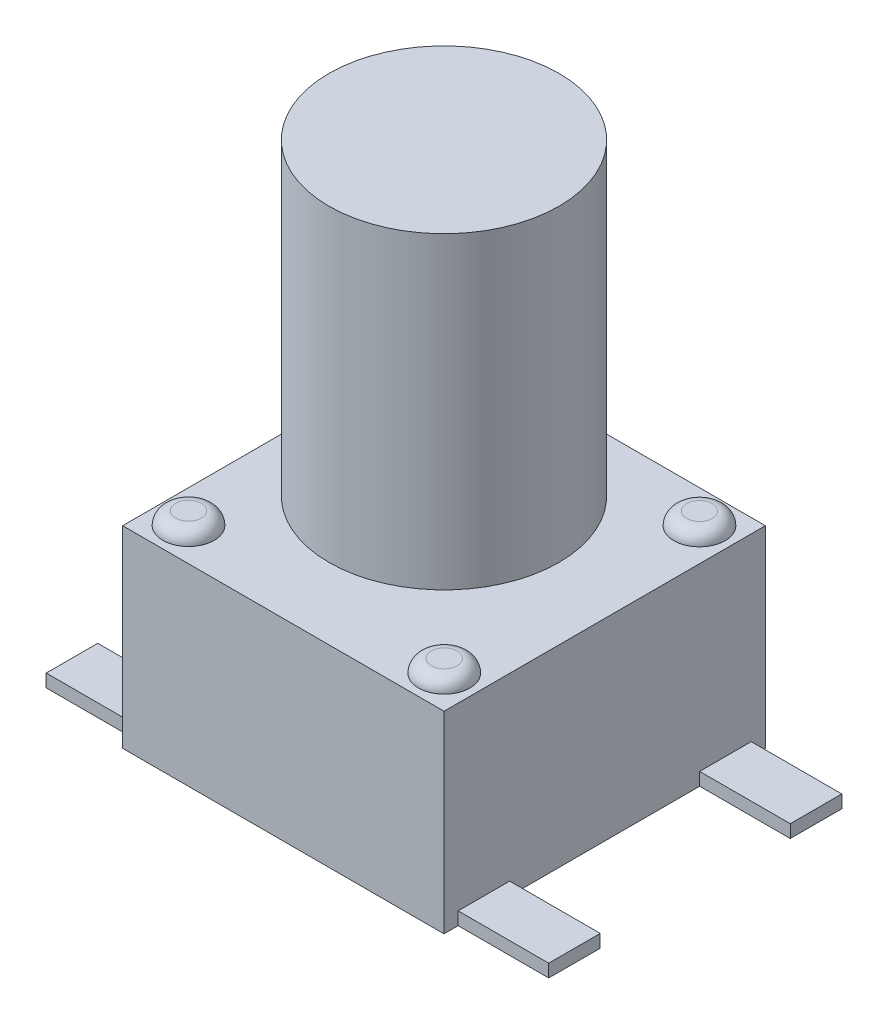
ISO-10303-21;
HEADER;
FILE_DESCRIPTION(('STEP AP214'),'2;1');
FILE_NAME('part.step','',(''),(''),'','','');
FILE_SCHEMA(('AUTOMOTIVE_DESIGN { 1 0 10303 214 1 1 1 1 }'));
ENDSEC;
DATA;
#1=APPLICATION_CONTEXT('core data for automotive mechanical design processes');
#2=APPLICATION_PROTOCOL_DEFINITION('international standard','automotive_design',2000,#1);
#3=PRODUCT_CONTEXT('',#1,'mechanical');
#4=PRODUCT('Part','Part','',(#3));
#5=PRODUCT_RELATED_PRODUCT_CATEGORY('part','',(#4));
#6=PRODUCT_DEFINITION_FORMATION('','',#4);
#7=PRODUCT_DEFINITION_CONTEXT('part definition',#1,'design');
#8=PRODUCT_DEFINITION('design','',#6,#7);
#9=PRODUCT_DEFINITION_SHAPE('','',#8);
#10=(LENGTH_UNIT() NAMED_UNIT(*) SI_UNIT(.MILLI.,.METRE.));
#11=(NAMED_UNIT(*) PLANE_ANGLE_UNIT() SI_UNIT($,.RADIAN.));
#12=(NAMED_UNIT(*) SI_UNIT($,.STERADIAN.) SOLID_ANGLE_UNIT());
#13=UNCERTAINTY_MEASURE_WITH_UNIT(LENGTH_MEASURE(1.E-05),#10,'distance_accuracy_value','');
#14=(GEOMETRIC_REPRESENTATION_CONTEXT(3) GLOBAL_UNCERTAINTY_ASSIGNED_CONTEXT((#13)) GLOBAL_UNIT_ASSIGNED_CONTEXT((#10,
#11,#12)) REPRESENTATION_CONTEXT('',''));
#15=CARTESIAN_POINT('',(0.,0.,0.));
#16=DIRECTION('',(0.,0.,1.));
#17=DIRECTION('',(1.,0.,0.));
#18=AXIS2_PLACEMENT_3D('',#15,#16,#17);
#19=CARTESIAN_POINT('',(3.175,3.81,-3.175));
#20=DIRECTION('',(0.,-1.,0.));
#21=DIRECTION('',(0.,0.,-1.));
#22=AXIS2_PLACEMENT_3D('',#19,#20,#21);
#23=PLANE('',#22);
#24=CARTESIAN_POINT('',(-2.5268305975324,3.81,2.52160987315735));
#25=DIRECTION('',(0.,-1.,0.));
#26=DIRECTION('',(0.,0.,-1.));
#27=AXIS2_PLACEMENT_3D('',#24,#25,#26);
#28=CIRCLE('',#27,0.508);
#29=CARTESIAN_POINT('',(-2.5268305975324,3.81,2.01360987315735));
#30=VERTEX_POINT('',#29);
#31=EDGE_CURVE('E488',#30,#30,#28,.F.);
#32=ORIENTED_EDGE('',*,*,#31,.F.);
#33=EDGE_LOOP('',(#32));
#34=FACE_BOUND('',#33,.T.);
#35=CARTESIAN_POINT('',(2.5268305975324,3.81,-2.52160987315735));
#36=DIRECTION('',(0.,-1.,0.));
#37=DIRECTION('',(0.,0.,-1.));
#38=AXIS2_PLACEMENT_3D('',#35,#36,#37);
#39=CIRCLE('',#38,0.508);
#40=CARTESIAN_POINT('',(2.5268305975324,3.81,-3.02960987315735));
#41=VERTEX_POINT('',#40);
#42=EDGE_CURVE('E491',#41,#41,#39,.F.);
#43=ORIENTED_EDGE('',*,*,#42,.F.);
#44=EDGE_LOOP('',(#43));
#45=FACE_BOUND('',#44,.T.);
#46=DIRECTION('',(0.,0.,-1.));
#47=VECTOR('',#46,1.);
#48=CARTESIAN_POINT('',(3.175,3.81,3.175));
#49=LINE('',#48,#47);
#50=CARTESIAN_POINT('',(3.175,3.81,3.175));
#51=VERTEX_POINT('',#50);
#52=CARTESIAN_POINT('',(3.175,3.81,-3.175));
#53=VERTEX_POINT('',#52);
#54=EDGE_CURVE('E303',#51,#53,#49,.T.);
#55=ORIENTED_EDGE('',*,*,#54,.T.);
#56=DIRECTION('',(-1.,0.,0.));
#57=VECTOR('',#56,1.);
#58=CARTESIAN_POINT('',(-3.175,3.81,-3.175));
#59=LINE('',#58,#57);
#60=CARTESIAN_POINT('',(-3.175,3.81,-3.175));
#61=VERTEX_POINT('',#60);
#62=EDGE_CURVE('E300',#53,#61,#59,.T.);
#63=ORIENTED_EDGE('',*,*,#62,.T.);
#64=DIRECTION('',(0.,0.,1.));
#65=VECTOR('',#64,1.);
#66=CARTESIAN_POINT('',(-3.175,3.81,3.175));
#67=LINE('',#66,#65);
#68=CARTESIAN_POINT('',(-3.175,3.81,3.175));
#69=VERTEX_POINT('',#68);
#70=EDGE_CURVE('E296',#61,#69,#67,.T.);
#71=ORIENTED_EDGE('',*,*,#70,.T.);
#72=DIRECTION('',(1.,0.,0.));
#73=VECTOR('',#72,1.);
#74=CARTESIAN_POINT('',(-3.175,3.81,3.175));
#75=LINE('',#74,#73);
#76=EDGE_CURVE('E255',#69,#51,#75,.T.);
#77=ORIENTED_EDGE('',*,*,#76,.T.);
#78=EDGE_LOOP('',(#55,#63,#71,#77));
#79=FACE_BOUND('',#78,.T.);
#80=CARTESIAN_POINT('',(-2.5268305975324,3.81,-2.52160987315735));
#81=DIRECTION('',(0.,-1.,0.));
#82=DIRECTION('',(0.,0.,-1.));
#83=AXIS2_PLACEMENT_3D('',#80,#81,#82);
#84=CIRCLE('',#83,0.508);
#85=CARTESIAN_POINT('',(-2.5268305975324,3.81,-3.02960987315735));
#86=VERTEX_POINT('',#85);
#87=EDGE_CURVE('E250',#86,#86,#84,.F.);
#88=ORIENTED_EDGE('',*,*,#87,.F.);
#89=EDGE_LOOP('',(#88));
#90=FACE_BOUND('',#89,.T.);
#91=CARTESIAN_POINT('',(2.5268305975324,3.81,2.52160987315735));
#92=DIRECTION('',(0.,-1.,0.));
#93=DIRECTION('',(0.,0.,-1.));
#94=AXIS2_PLACEMENT_3D('',#91,#92,#93);
#95=CIRCLE('',#94,0.508);
#96=CARTESIAN_POINT('',(2.5268305975324,3.81,2.01360987315735));
#97=VERTEX_POINT('',#96);
#98=EDGE_CURVE('E474',#97,#97,#95,.F.);
#99=ORIENTED_EDGE('',*,*,#98,.F.);
#100=EDGE_LOOP('',(#99));
#101=FACE_BOUND('',#100,.T.);
#102=CARTESIAN_POINT('',(0.,3.81,0.));
#103=DIRECTION('',(0.,-1.,0.));
#104=DIRECTION('',(0.,0.,-1.));
#105=AXIS2_PLACEMENT_3D('',#102,#103,#104);
#106=CIRCLE('',#105,1.36304718396633);
#107=CARTESIAN_POINT('',(0.,3.81,-1.36304718396633));
#108=VERTEX_POINT('',#107);
#109=EDGE_CURVE('E11',#108,#108,#106,.F.);
#110=ORIENTED_EDGE('',*,*,#109,.F.);
#111=EDGE_LOOP('',(#110));
#112=FACE_BOUND('',#111,.T.);
#113=ADVANCED_FACE('F35',(#34,#45,#79,#90,#101,#112),#23,.F.);
#114=CARTESIAN_POINT('',(3.175,3.81,3.175));
#115=DIRECTION('',(-1.,0.,0.));
#116=DIRECTION('',(0.,0.,1.));
#117=AXIS2_PLACEMENT_3D('',#114,#115,#116);
#118=PLANE('',#117);
#119=DIRECTION('',(0.,0.,-1.));
#120=VECTOR('',#119,1.);
#121=CARTESIAN_POINT('',(3.175,0.,3.175));
#122=LINE('',#121,#120);
#123=CARTESIAN_POINT('',(3.175,0.,1.87744641540056));
#124=VERTEX_POINT('',#123);
#125=CARTESIAN_POINT('',(3.175,0.,-1.87744641540056));
#126=VERTEX_POINT('',#125);
#127=EDGE_CURVE('E248',#124,#126,#122,.T.);
#128=ORIENTED_EDGE('',*,*,#127,.T.);
#129=DIRECTION('',(0.,-1.,0.));
#130=VECTOR('',#129,1.);
#131=CARTESIAN_POINT('',(3.175,0.254,-1.87744641540056));
#132=LINE('',#131,#130);
#133=CARTESIAN_POINT('',(3.175,0.254,-1.87744641540056));
#134=VERTEX_POINT('',#133);
#135=EDGE_CURVE('E50',#134,#126,#132,.T.);
#136=ORIENTED_EDGE('',*,*,#135,.F.);
#137=DIRECTION('',(0.,0.,-1.));
#138=VECTOR('',#137,1.);
#139=CARTESIAN_POINT('',(3.175,0.254,-1.87744641540056));
#140=LINE('',#139,#138);
#141=CARTESIAN_POINT('',(3.175,0.254,-2.8956));
#142=VERTEX_POINT('',#141);
#143=EDGE_CURVE('E54',#134,#142,#140,.T.);
#144=ORIENTED_EDGE('',*,*,#143,.T.);
#145=DIRECTION('',(0.,-1.,0.));
#146=VECTOR('',#145,1.);
#147=CARTESIAN_POINT('',(3.175,0.254,-2.8956));
#148=LINE('',#147,#146);
#149=CARTESIAN_POINT('',(3.175,0.,-2.8956));
#150=VERTEX_POINT('',#149);
#151=EDGE_CURVE('E182',#142,#150,#148,.T.);
#152=ORIENTED_EDGE('',*,*,#151,.T.);
#153=CARTESIAN_POINT('',(3.175,0.,-3.175));
#154=VERTEX_POINT('',#153);
#155=EDGE_CURVE('E245',#150,#154,#122,.T.);
#156=ORIENTED_EDGE('',*,*,#155,.T.);
#157=DIRECTION('',(0.,-1.,0.));
#158=VECTOR('',#157,1.);
#159=CARTESIAN_POINT('',(3.175,3.81,-3.175));
#160=LINE('',#159,#158);
#161=EDGE_CURVE('E283',#53,#154,#160,.T.);
#162=ORIENTED_EDGE('',*,*,#161,.F.);
#163=ORIENTED_EDGE('',*,*,#54,.F.);
#164=DIRECTION('',(0.,-1.,0.));
#165=VECTOR('',#164,1.);
#166=CARTESIAN_POINT('',(3.175,3.81,3.175));
#167=LINE('',#166,#165);
#168=CARTESIAN_POINT('',(3.175,0.,3.175));
#169=VERTEX_POINT('',#168);
#170=EDGE_CURVE('E291',#51,#169,#167,.T.);
#171=ORIENTED_EDGE('',*,*,#170,.T.);
#172=CARTESIAN_POINT('',(3.175,0.,2.8956));
#173=VERTEX_POINT('',#172);
#174=EDGE_CURVE('E263',#169,#173,#122,.T.);
#175=ORIENTED_EDGE('',*,*,#174,.T.);
#176=DIRECTION('',(0.,-1.,0.));
#177=VECTOR('',#176,1.);
#178=CARTESIAN_POINT('',(3.175,0.254,2.8956));
#179=LINE('',#178,#177);
#180=CARTESIAN_POINT('',(3.175,0.254,2.8956));
#181=VERTEX_POINT('',#180);
#182=EDGE_CURVE('E235',#181,#173,#179,.T.);
#183=ORIENTED_EDGE('',*,*,#182,.F.);
#184=DIRECTION('',(0.,0.,-1.));
#185=VECTOR('',#184,1.);
#186=CARTESIAN_POINT('',(3.175,0.254,1.87744641540056));
#187=LINE('',#186,#185);
#188=CARTESIAN_POINT('',(3.175,0.254,1.87744641540056));
#189=VERTEX_POINT('',#188);
#190=EDGE_CURVE('E214',#181,#189,#187,.T.);
#191=ORIENTED_EDGE('',*,*,#190,.T.);
#192=DIRECTION('',(0.,-1.,0.));
#193=VECTOR('',#192,1.);
#194=CARTESIAN_POINT('',(3.175,0.254,1.87744641540056));
#195=LINE('',#194,#193);
#196=EDGE_CURVE('E227',#189,#124,#195,.T.);
#197=ORIENTED_EDGE('',*,*,#196,.T.);
#198=EDGE_LOOP('',(#128,#136,#144,#152,#156,#162,#163,#171,#175,#183,#191,#197));
#199=FACE_BOUND('',#198,.T.);
#200=ADVANCED_FACE('F392',(#199),#118,.F.);
#201=CARTESIAN_POINT('',(-3.175,3.81,3.175));
#202=DIRECTION('',(1.,0.,0.));
#203=DIRECTION('',(0.,0.,-1.));
#204=AXIS2_PLACEMENT_3D('',#201,#202,#203);
#205=PLANE('',#204);
#206=DIRECTION('',(0.,0.,1.));
#207=VECTOR('',#206,1.);
#208=CARTESIAN_POINT('',(-3.175,0.,3.175));
#209=LINE('',#208,#207);
#210=CARTESIAN_POINT('',(-3.175,0.,-1.87744641540056));
#211=VERTEX_POINT('',#210);
#212=CARTESIAN_POINT('',(-3.175,0.,1.87744641540056));
#213=VERTEX_POINT('',#212);
#214=EDGE_CURVE('E268',#211,#213,#209,.T.);
#215=ORIENTED_EDGE('',*,*,#214,.T.);
#216=DIRECTION('',(0.,-1.,0.));
#217=VECTOR('',#216,1.);
#218=CARTESIAN_POINT('',(-3.175,0.254,1.87744641540056));
#219=LINE('',#218,#217);
#220=CARTESIAN_POINT('',(-3.175,0.254,1.87744641540056));
#221=VERTEX_POINT('',#220);
#222=EDGE_CURVE('E332',#221,#213,#219,.T.);
#223=ORIENTED_EDGE('',*,*,#222,.F.);
#224=DIRECTION('',(0.,0.,1.));
#225=VECTOR('',#224,1.);
#226=CARTESIAN_POINT('',(-3.175,0.254,1.87744641540056));
#227=LINE('',#226,#225);
#228=CARTESIAN_POINT('',(-3.175,0.254,2.8956));
#229=VERTEX_POINT('',#228);
#230=EDGE_CURVE('E358',#221,#229,#227,.T.);
#231=ORIENTED_EDGE('',*,*,#230,.T.);
#232=DIRECTION('',(0.,-1.,0.));
#233=VECTOR('',#232,1.);
#234=CARTESIAN_POINT('',(-3.175,0.254,2.8956));
#235=LINE('',#234,#233);
#236=CARTESIAN_POINT('',(-3.175,0.,2.8956));
#237=VERTEX_POINT('',#236);
#238=EDGE_CURVE('E348',#229,#237,#235,.T.);
#239=ORIENTED_EDGE('',*,*,#238,.T.);
#240=CARTESIAN_POINT('',(-3.175,0.,3.175));
#241=VERTEX_POINT('',#240);
#242=EDGE_CURVE('E266',#237,#241,#209,.T.);
#243=ORIENTED_EDGE('',*,*,#242,.T.);
#244=DIRECTION('',(0.,-1.,0.));
#245=VECTOR('',#244,1.);
#246=CARTESIAN_POINT('',(-3.175,3.81,3.175));
#247=LINE('',#246,#245);
#248=EDGE_CURVE('E289',#69,#241,#247,.T.);
#249=ORIENTED_EDGE('',*,*,#248,.F.);
#250=ORIENTED_EDGE('',*,*,#70,.F.);
#251=DIRECTION('',(0.,-1.,0.));
#252=VECTOR('',#251,1.);
#253=CARTESIAN_POINT('',(-3.175,3.81,-3.175));
#254=LINE('',#253,#252);
#255=CARTESIAN_POINT('',(-3.175,0.,-3.175));
#256=VERTEX_POINT('',#255);
#257=EDGE_CURVE('E286',#61,#256,#254,.T.);
#258=ORIENTED_EDGE('',*,*,#257,.T.);
#259=CARTESIAN_POINT('',(-3.175,0.,-2.8956));
#260=VERTEX_POINT('',#259);
#261=EDGE_CURVE('E280',#256,#260,#209,.T.);
#262=ORIENTED_EDGE('',*,*,#261,.T.);
#263=DIRECTION('',(0.,-1.,0.));
#264=VECTOR('',#263,1.);
#265=CARTESIAN_POINT('',(-3.175,0.254,-2.8956));
#266=LINE('',#265,#264);
#267=CARTESIAN_POINT('',(-3.175,0.254,-2.8956));
#268=VERTEX_POINT('',#267);
#269=EDGE_CURVE('E309',#268,#260,#266,.T.);
#270=ORIENTED_EDGE('',*,*,#269,.F.);
#271=DIRECTION('',(0.,0.,1.));
#272=VECTOR('',#271,1.);
#273=CARTESIAN_POINT('',(-3.175,0.254,-1.87744641540056));
#274=LINE('',#273,#272);
#275=CARTESIAN_POINT('',(-3.175,0.254,-1.87744641540056));
#276=VERTEX_POINT('',#275);
#277=EDGE_CURVE('E340',#268,#276,#274,.T.);
#278=ORIENTED_EDGE('',*,*,#277,.T.);
#279=DIRECTION('',(0.,-1.,0.));
#280=VECTOR('',#279,1.);
#281=CARTESIAN_POINT('',(-3.175,0.254,-1.87744641540056));
#282=LINE('',#281,#280);
#283=EDGE_CURVE('E315',#276,#211,#282,.T.);
#284=ORIENTED_EDGE('',*,*,#283,.T.);
#285=EDGE_LOOP('',(#215,#223,#231,#239,#243,#249,#250,#258,#262,#270,#278,#284));
#286=FACE_BOUND('',#285,.T.);
#287=ADVANCED_FACE('F374',(#286),#205,.F.);
#288=CARTESIAN_POINT('',(-3.175,3.81,-3.175));
#289=DIRECTION('',(0.,0.,1.));
#290=DIRECTION('',(1.,0.,0.));
#291=AXIS2_PLACEMENT_3D('',#288,#289,#290);
#292=PLANE('',#291);
#293=DIRECTION('',(-1.,0.,0.));
#294=VECTOR('',#293,1.);
#295=CARTESIAN_POINT('',(-3.175,0.,-3.175));
#296=LINE('',#295,#294);
#297=EDGE_CURVE('E257',#154,#256,#296,.T.);
#298=ORIENTED_EDGE('',*,*,#297,.T.);
#299=ORIENTED_EDGE('',*,*,#257,.F.);
#300=ORIENTED_EDGE('',*,*,#62,.F.);
#301=ORIENTED_EDGE('',*,*,#161,.T.);
#302=EDGE_LOOP('',(#298,#299,#300,#301));
#303=FACE_BOUND('',#302,.T.);
#304=ADVANCED_FACE('F396',(#303),#292,.F.);
#305=CARTESIAN_POINT('',(-3.175,3.81,3.175));
#306=DIRECTION('',(0.,0.,-1.));
#307=DIRECTION('',(-1.,0.,0.));
#308=AXIS2_PLACEMENT_3D('',#305,#306,#307);
#309=PLANE('',#308);
#310=DIRECTION('',(1.,0.,0.));
#311=VECTOR('',#310,1.);
#312=CARTESIAN_POINT('',(-3.175,0.,3.175));
#313=LINE('',#312,#311);
#314=EDGE_CURVE('E273',#241,#169,#313,.T.);
#315=ORIENTED_EDGE('',*,*,#314,.T.);
#316=ORIENTED_EDGE('',*,*,#170,.F.);
#317=ORIENTED_EDGE('',*,*,#76,.F.);
#318=ORIENTED_EDGE('',*,*,#248,.T.);
#319=EDGE_LOOP('',(#315,#316,#317,#318));
#320=FACE_BOUND('',#319,.T.);
#321=ADVANCED_FACE('F390',(#320),#309,.F.);
#322=CARTESIAN_POINT('',(3.175,0.,-3.175));
#323=DIRECTION('',(0.,-1.,0.));
#324=DIRECTION('',(0.,0.,-1.));
#325=AXIS2_PLACEMENT_3D('',#322,#323,#324);
#326=PLANE('',#325);
#327=ORIENTED_EDGE('',*,*,#174,.F.);
#328=ORIENTED_EDGE('',*,*,#314,.F.);
#329=ORIENTED_EDGE('',*,*,#242,.F.);
#330=DIRECTION('',(-1.,0.,0.));
#331=VECTOR('',#330,1.);
#332=CARTESIAN_POINT('',(-4.96477558047559,0.,2.8956));
#333=LINE('',#332,#331);
#334=CARTESIAN_POINT('',(-4.96477558047559,0.,2.8956));
#335=VERTEX_POINT('',#334);
#336=EDGE_CURVE('E226',#237,#335,#333,.T.);
#337=ORIENTED_EDGE('',*,*,#336,.T.);
#338=DIRECTION('',(0.,0.,-1.));
#339=VECTOR('',#338,1.);
#340=CARTESIAN_POINT('',(-4.96477558047559,0.,1.87744641540056));
#341=LINE('',#340,#339);
#342=CARTESIAN_POINT('',(-4.96477558047559,0.,1.87744641540056));
#343=VERTEX_POINT('',#342);
#344=EDGE_CURVE('E359',#335,#343,#341,.T.);
#345=ORIENTED_EDGE('',*,*,#344,.T.);
#346=DIRECTION('',(1.,0.,0.));
#347=VECTOR('',#346,1.);
#348=CARTESIAN_POINT('',(-4.96477558047559,0.,1.87744641540056));
#349=LINE('',#348,#347);
#350=EDGE_CURVE('E355',#343,#213,#349,.T.);
#351=ORIENTED_EDGE('',*,*,#350,.T.);
#352=ORIENTED_EDGE('',*,*,#214,.F.);
#353=DIRECTION('',(-1.,0.,0.));
#354=VECTOR('',#353,1.);
#355=CARTESIAN_POINT('',(-4.96477558047559,0.,-1.87744641540056));
#356=LINE('',#355,#354);
#357=CARTESIAN_POINT('',(-4.96477558047559,0.,-1.87744641540056));
#358=VERTEX_POINT('',#357);
#359=EDGE_CURVE('E324',#211,#358,#356,.T.);
#360=ORIENTED_EDGE('',*,*,#359,.T.);
#361=DIRECTION('',(0.,0.,-1.));
#362=VECTOR('',#361,1.);
#363=CARTESIAN_POINT('',(-4.96477558047559,0.,-1.87744641540056));
#364=LINE('',#363,#362);
#365=CARTESIAN_POINT('',(-4.96477558047559,0.,-2.8956));
#366=VERTEX_POINT('',#365);
#367=EDGE_CURVE('E325',#358,#366,#364,.T.);
#368=ORIENTED_EDGE('',*,*,#367,.T.);
#369=DIRECTION('',(1.,0.,0.));
#370=VECTOR('',#369,1.);
#371=CARTESIAN_POINT('',(-4.96477558047559,0.,-2.8956));
#372=LINE('',#371,#370);
#373=EDGE_CURVE('E322',#366,#260,#372,.T.);
#374=ORIENTED_EDGE('',*,*,#373,.T.);
#375=ORIENTED_EDGE('',*,*,#261,.F.);
#376=ORIENTED_EDGE('',*,*,#297,.F.);
#377=ORIENTED_EDGE('',*,*,#155,.F.);
#378=DIRECTION('',(1.,0.,0.));
#379=VECTOR('',#378,1.);
#380=CARTESIAN_POINT('',(4.96477558047559,0.,-2.8956));
#381=LINE('',#380,#379);
#382=CARTESIAN_POINT('',(4.96477558047559,0.,-2.8956));
#383=VERTEX_POINT('',#382);
#384=EDGE_CURVE('E200',#150,#383,#381,.T.);
#385=ORIENTED_EDGE('',*,*,#384,.T.);
#386=DIRECTION('',(0.,0.,1.));
#387=VECTOR('',#386,1.);
#388=CARTESIAN_POINT('',(4.96477558047559,0.,-1.87744641540056));
#389=LINE('',#388,#387);
#390=CARTESIAN_POINT('',(4.96477558047559,0.,-1.87744641540056));
#391=VERTEX_POINT('',#390);
#392=EDGE_CURVE('E177',#383,#391,#389,.T.);
#393=ORIENTED_EDGE('',*,*,#392,.T.);
#394=DIRECTION('',(-1.,0.,0.));
#395=VECTOR('',#394,1.);
#396=CARTESIAN_POINT('',(4.96477558047559,0.,-1.87744641540056));
#397=LINE('',#396,#395);
#398=EDGE_CURVE('E197',#391,#126,#397,.T.);
#399=ORIENTED_EDGE('',*,*,#398,.T.);
#400=ORIENTED_EDGE('',*,*,#127,.F.);
#401=DIRECTION('',(1.,0.,0.));
#402=VECTOR('',#401,1.);
#403=CARTESIAN_POINT('',(4.96477558047559,0.,1.87744641540056));
#404=LINE('',#403,#402);
#405=CARTESIAN_POINT('',(4.96477558047559,0.,1.87744641540056));
#406=VERTEX_POINT('',#405);
#407=EDGE_CURVE('E211',#124,#406,#404,.T.);
#408=ORIENTED_EDGE('',*,*,#407,.T.);
#409=DIRECTION('',(0.,0.,1.));
#410=VECTOR('',#409,1.);
#411=CARTESIAN_POINT('',(4.96477558047559,0.,1.87744641540056));
#412=LINE('',#411,#410);
#413=CARTESIAN_POINT('',(4.96477558047559,0.,2.8956));
#414=VERTEX_POINT('',#413);
#415=EDGE_CURVE('E204',#406,#414,#412,.T.);
#416=ORIENTED_EDGE('',*,*,#415,.T.);
#417=DIRECTION('',(-1.,0.,0.));
#418=VECTOR('',#417,1.);
#419=CARTESIAN_POINT('',(4.96477558047559,0.,2.8956));
#420=LINE('',#419,#418);
#421=EDGE_CURVE('E223',#414,#173,#420,.T.);
#422=ORIENTED_EDGE('',*,*,#421,.T.);
#423=EDGE_LOOP('',(#327,#328,#329,#337,#345,#351,#352,#360,#368,#374,#375,#376,#377,#385,#393,
#399,#400,#408,#416,#422));
#424=FACE_BOUND('',#423,.T.);
#425=ADVANCED_FACE('F387',(#424),#326,.T.);
#426=CARTESIAN_POINT('',(-4.96477558047559,0.254,-1.87744641540056));
#427=DIRECTION('',(-1.,0.,0.));
#428=DIRECTION('',(0.,0.,1.));
#429=AXIS2_PLACEMENT_3D('',#426,#427,#428);
#430=PLANE('',#429);
#431=ORIENTED_EDGE('',*,*,#367,.F.);
#432=DIRECTION('',(0.,-1.,0.));
#433=VECTOR('',#432,1.);
#434=CARTESIAN_POINT('',(-4.96477558047559,0.254,-1.87744641540056));
#435=LINE('',#434,#433);
#436=CARTESIAN_POINT('',(-4.96477558047559,0.254,-1.87744641540056));
#437=VERTEX_POINT('',#436);
#438=EDGE_CURVE('E249',#437,#358,#435,.T.);
#439=ORIENTED_EDGE('',*,*,#438,.F.);
#440=DIRECTION('',(0.,0.,-1.));
#441=VECTOR('',#440,1.);
#442=CARTESIAN_POINT('',(-4.96477558047559,0.254,-1.87744641540056));
#443=LINE('',#442,#441);
#444=CARTESIAN_POINT('',(-4.96477558047559,0.254,-2.8956));
#445=VERTEX_POINT('',#444);
#446=EDGE_CURVE('E331',#437,#445,#443,.T.);
#447=ORIENTED_EDGE('',*,*,#446,.T.);
#448=DIRECTION('',(0.,-1.,0.));
#449=VECTOR('',#448,1.);
#450=CARTESIAN_POINT('',(-4.96477558047559,0.254,-2.8956));
#451=LINE('',#450,#449);
#452=EDGE_CURVE('E307',#445,#366,#451,.T.);
#453=ORIENTED_EDGE('',*,*,#452,.T.);
#454=EDGE_LOOP('',(#431,#439,#447,#453));
#455=FACE_BOUND('',#454,.T.);
#456=ADVANCED_FACE('F446',(#455),#430,.T.);
#457=CARTESIAN_POINT('',(-4.96477558047559,0.254,-1.87744641540056));
#458=DIRECTION('',(0.,0.,1.));
#459=DIRECTION('',(1.,0.,0.));
#460=AXIS2_PLACEMENT_3D('',#457,#458,#459);
#461=PLANE('',#460);
#462=ORIENTED_EDGE('',*,*,#359,.F.);
#463=ORIENTED_EDGE('',*,*,#283,.F.);
#464=DIRECTION('',(-1.,0.,0.));
#465=VECTOR('',#464,1.);
#466=CARTESIAN_POINT('',(-4.96477558047559,0.254,-1.87744641540056));
#467=LINE('',#466,#465);
#468=EDGE_CURVE('E310',#276,#437,#467,.T.);
#469=ORIENTED_EDGE('',*,*,#468,.T.);
#470=ORIENTED_EDGE('',*,*,#438,.T.);
#471=EDGE_LOOP('',(#462,#463,#469,#470));
#472=FACE_BOUND('',#471,.T.);
#473=ADVANCED_FACE('F551',(#472),#461,.T.);
#474=CARTESIAN_POINT('',(-4.96477558047559,0.254,-2.8956));
#475=DIRECTION('',(0.,0.,-1.));
#476=DIRECTION('',(-1.,0.,0.));
#477=AXIS2_PLACEMENT_3D('',#474,#475,#476);
#478=PLANE('',#477);
#479=ORIENTED_EDGE('',*,*,#373,.F.);
#480=ORIENTED_EDGE('',*,*,#452,.F.);
#481=DIRECTION('',(1.,0.,0.));
#482=VECTOR('',#481,1.);
#483=CARTESIAN_POINT('',(-4.96477558047559,0.254,-2.8956));
#484=LINE('',#483,#482);
#485=EDGE_CURVE('E343',#445,#268,#484,.T.);
#486=ORIENTED_EDGE('',*,*,#485,.T.);
#487=ORIENTED_EDGE('',*,*,#269,.T.);
#488=EDGE_LOOP('',(#479,#480,#486,#487));
#489=FACE_BOUND('',#488,.T.);
#490=ADVANCED_FACE('F549',(#489),#478,.T.);
#491=CARTESIAN_POINT('',(-4.96477558047559,0.254,-2.8956));
#492=DIRECTION('',(0.,-1.,0.));
#493=DIRECTION('',(0.,0.,-1.));
#494=AXIS2_PLACEMENT_3D('',#491,#492,#493);
#495=PLANE('',#494);
#496=ORIENTED_EDGE('',*,*,#446,.F.);
#497=ORIENTED_EDGE('',*,*,#468,.F.);
#498=ORIENTED_EDGE('',*,*,#277,.F.);
#499=ORIENTED_EDGE('',*,*,#485,.F.);
#500=EDGE_LOOP('',(#496,#497,#498,#499));
#501=FACE_BOUND('',#500,.T.);
#502=ADVANCED_FACE('F541',(#501),#495,.F.);
#503=CARTESIAN_POINT('',(-4.96477558047559,0.254,1.87744641540056));
#504=DIRECTION('',(0.,0.,-1.));
#505=DIRECTION('',(-1.,0.,0.));
#506=AXIS2_PLACEMENT_3D('',#503,#504,#505);
#507=PLANE('',#506);
#508=ORIENTED_EDGE('',*,*,#350,.F.);
#509=DIRECTION('',(0.,-1.,0.));
#510=VECTOR('',#509,1.);
#511=CARTESIAN_POINT('',(-4.96477558047559,0.254,1.87744641540056));
#512=LINE('',#511,#510);
#513=CARTESIAN_POINT('',(-4.96477558047559,0.254,1.87744641540056));
#514=VERTEX_POINT('',#513);
#515=EDGE_CURVE('E335',#514,#343,#512,.T.);
#516=ORIENTED_EDGE('',*,*,#515,.F.);
#517=DIRECTION('',(1.,0.,0.));
#518=VECTOR('',#517,1.);
#519=CARTESIAN_POINT('',(-4.96477558047559,0.254,1.87744641540056));
#520=LINE('',#519,#518);
#521=EDGE_CURVE('E352',#514,#221,#520,.T.);
#522=ORIENTED_EDGE('',*,*,#521,.T.);
#523=ORIENTED_EDGE('',*,*,#222,.T.);
#524=EDGE_LOOP('',(#508,#516,#522,#523));
#525=FACE_BOUND('',#524,.T.);
#526=ADVANCED_FACE('F538',(#525),#507,.T.);
#527=CARTESIAN_POINT('',(-4.96477558047559,0.254,1.87744641540056));
#528=DIRECTION('',(-1.,0.,0.));
#529=DIRECTION('',(0.,0.,1.));
#530=AXIS2_PLACEMENT_3D('',#527,#528,#529);
#531=PLANE('',#530);
#532=ORIENTED_EDGE('',*,*,#344,.F.);
#533=DIRECTION('',(0.,-1.,0.));
#534=VECTOR('',#533,1.);
#535=CARTESIAN_POINT('',(-4.96477558047559,0.254,2.8956));
#536=LINE('',#535,#534);
#537=CARTESIAN_POINT('',(-4.96477558047559,0.254,2.8956));
#538=VERTEX_POINT('',#537);
#539=EDGE_CURVE('E351',#538,#335,#536,.T.);
#540=ORIENTED_EDGE('',*,*,#539,.F.);
#541=DIRECTION('',(0.,0.,-1.));
#542=VECTOR('',#541,1.);
#543=CARTESIAN_POINT('',(-4.96477558047559,0.254,1.87744641540056));
#544=LINE('',#543,#542);
#545=EDGE_CURVE('E366',#538,#514,#544,.T.);
#546=ORIENTED_EDGE('',*,*,#545,.T.);
#547=ORIENTED_EDGE('',*,*,#515,.T.);
#548=EDGE_LOOP('',(#532,#540,#546,#547));
#549=FACE_BOUND('',#548,.T.);
#550=ADVANCED_FACE('F385',(#549),#531,.T.);
#551=CARTESIAN_POINT('',(-4.96477558047559,0.254,2.8956));
#552=DIRECTION('',(0.,0.,1.));
#553=DIRECTION('',(1.,0.,0.));
#554=AXIS2_PLACEMENT_3D('',#551,#552,#553);
#555=PLANE('',#554);
#556=ORIENTED_EDGE('',*,*,#336,.F.);
#557=ORIENTED_EDGE('',*,*,#238,.F.);
#558=DIRECTION('',(-1.,0.,0.));
#559=VECTOR('',#558,1.);
#560=CARTESIAN_POINT('',(-4.96477558047559,0.254,2.8956));
#561=LINE('',#560,#559);
#562=EDGE_CURVE('E369',#229,#538,#561,.T.);
#563=ORIENTED_EDGE('',*,*,#562,.T.);
#564=ORIENTED_EDGE('',*,*,#539,.T.);
#565=EDGE_LOOP('',(#556,#557,#563,#564));
#566=FACE_BOUND('',#565,.T.);
#567=ADVANCED_FACE('F380',(#566),#555,.T.);
#568=CARTESIAN_POINT('',(-3.175,0.254,2.8956));
#569=DIRECTION('',(0.,1.,0.));
#570=DIRECTION('',(0.,0.,1.));
#571=AXIS2_PLACEMENT_3D('',#568,#569,#570);
#572=PLANE('',#571);
#573=ORIENTED_EDGE('',*,*,#230,.F.);
#574=ORIENTED_EDGE('',*,*,#521,.F.);
#575=ORIENTED_EDGE('',*,*,#545,.F.);
#576=ORIENTED_EDGE('',*,*,#562,.F.);
#577=EDGE_LOOP('',(#573,#574,#575,#576));
#578=FACE_BOUND('',#577,.T.);
#579=ADVANCED_FACE('F382',(#578),#572,.T.);
#580=CARTESIAN_POINT('',(4.96477558047559,0.254,1.87744641540056));
#581=DIRECTION('',(1.,0.,0.));
#582=DIRECTION('',(0.,0.,-1.));
#583=AXIS2_PLACEMENT_3D('',#580,#581,#582);
#584=PLANE('',#583);
#585=ORIENTED_EDGE('',*,*,#415,.F.);
#586=DIRECTION('',(0.,-1.,0.));
#587=VECTOR('',#586,1.);
#588=CARTESIAN_POINT('',(4.96477558047559,0.254,1.87744641540056));
#589=LINE('',#588,#587);
#590=CARTESIAN_POINT('',(4.96477558047559,0.254,1.87744641540056));
#591=VERTEX_POINT('',#590);
#592=EDGE_CURVE('E224',#591,#406,#589,.T.);
#593=ORIENTED_EDGE('',*,*,#592,.F.);
#594=DIRECTION('',(0.,0.,1.));
#595=VECTOR('',#594,1.);
#596=CARTESIAN_POINT('',(4.96477558047559,0.254,1.87744641540056));
#597=LINE('',#596,#595);
#598=CARTESIAN_POINT('',(4.96477558047559,0.254,2.8956));
#599=VERTEX_POINT('',#598);
#600=EDGE_CURVE('E207',#591,#599,#597,.T.);
#601=ORIENTED_EDGE('',*,*,#600,.T.);
#602=DIRECTION('',(0.,-1.,0.));
#603=VECTOR('',#602,1.);
#604=CARTESIAN_POINT('',(4.96477558047559,0.254,2.8956));
#605=LINE('',#604,#603);
#606=EDGE_CURVE('E220',#599,#414,#605,.T.);
#607=ORIENTED_EDGE('',*,*,#606,.T.);
#608=EDGE_LOOP('',(#585,#593,#601,#607));
#609=FACE_BOUND('',#608,.T.);
#610=ADVANCED_FACE('F528',(#609),#584,.T.);
#611=CARTESIAN_POINT('',(4.96477558047559,0.254,1.87744641540056));
#612=DIRECTION('',(0.,0.,-1.));
#613=DIRECTION('',(-1.,0.,0.));
#614=AXIS2_PLACEMENT_3D('',#611,#612,#613);
#615=PLANE('',#614);
#616=ORIENTED_EDGE('',*,*,#407,.F.);
#617=ORIENTED_EDGE('',*,*,#196,.F.);
#618=DIRECTION('',(1.,0.,0.));
#619=VECTOR('',#618,1.);
#620=CARTESIAN_POINT('',(4.96477558047559,0.254,1.87744641540056));
#621=LINE('',#620,#619);
#622=EDGE_CURVE('E217',#189,#591,#621,.T.);
#623=ORIENTED_EDGE('',*,*,#622,.T.);
#624=ORIENTED_EDGE('',*,*,#592,.T.);
#625=EDGE_LOOP('',(#616,#617,#623,#624));
#626=FACE_BOUND('',#625,.T.);
#627=ADVANCED_FACE('F525',(#626),#615,.T.);
#628=CARTESIAN_POINT('',(4.96477558047559,0.254,2.8956));
#629=DIRECTION('',(0.,0.,1.));
#630=DIRECTION('',(1.,0.,0.));
#631=AXIS2_PLACEMENT_3D('',#628,#629,#630);
#632=PLANE('',#631);
#633=ORIENTED_EDGE('',*,*,#421,.F.);
#634=ORIENTED_EDGE('',*,*,#606,.F.);
#635=DIRECTION('',(-1.,0.,0.));
#636=VECTOR('',#635,1.);
#637=CARTESIAN_POINT('',(4.96477558047559,0.254,2.8956));
#638=LINE('',#637,#636);
#639=EDGE_CURVE('E210',#599,#181,#638,.T.);
#640=ORIENTED_EDGE('',*,*,#639,.T.);
#641=ORIENTED_EDGE('',*,*,#182,.T.);
#642=EDGE_LOOP('',(#633,#634,#640,#641));
#643=FACE_BOUND('',#642,.T.);
#644=ADVANCED_FACE('F523',(#643),#632,.T.);
#645=CARTESIAN_POINT('',(4.96477558047559,0.254,2.8956));
#646=DIRECTION('',(0.,-1.,0.));
#647=DIRECTION('',(0.,0.,-1.));
#648=AXIS2_PLACEMENT_3D('',#645,#646,#647);
#649=PLANE('',#648);
#650=ORIENTED_EDGE('',*,*,#600,.F.);
#651=ORIENTED_EDGE('',*,*,#622,.F.);
#652=ORIENTED_EDGE('',*,*,#190,.F.);
#653=ORIENTED_EDGE('',*,*,#639,.F.);
#654=EDGE_LOOP('',(#650,#651,#652,#653));
#655=FACE_BOUND('',#654,.T.);
#656=ADVANCED_FACE('F520',(#655),#649,.F.);
#657=CARTESIAN_POINT('',(4.96477558047559,0.254,-1.87744641540056));
#658=DIRECTION('',(0.,0.,1.));
#659=DIRECTION('',(1.,0.,0.));
#660=AXIS2_PLACEMENT_3D('',#657,#658,#659);
#661=PLANE('',#660);
#662=ORIENTED_EDGE('',*,*,#398,.F.);
#663=DIRECTION('',(0.,-1.,0.));
#664=VECTOR('',#663,1.);
#665=CARTESIAN_POINT('',(4.96477558047559,0.254,-1.87744641540056));
#666=LINE('',#665,#664);
#667=CARTESIAN_POINT('',(4.96477558047559,0.254,-1.87744641540056));
#668=VERTEX_POINT('',#667);
#669=EDGE_CURVE('E181',#668,#391,#666,.T.);
#670=ORIENTED_EDGE('',*,*,#669,.F.);
#671=DIRECTION('',(-1.,0.,0.));
#672=VECTOR('',#671,1.);
#673=CARTESIAN_POINT('',(4.96477558047559,0.254,-1.87744641540056));
#674=LINE('',#673,#672);
#675=EDGE_CURVE('E192',#668,#134,#674,.T.);
#676=ORIENTED_EDGE('',*,*,#675,.T.);
#677=ORIENTED_EDGE('',*,*,#135,.T.);
#678=EDGE_LOOP('',(#662,#670,#676,#677));
#679=FACE_BOUND('',#678,.T.);
#680=ADVANCED_FACE('F403',(#679),#661,.T.);
#681=CARTESIAN_POINT('',(4.96477558047559,0.254,-1.87744641540056));
#682=DIRECTION('',(1.,0.,0.));
#683=DIRECTION('',(0.,0.,-1.));
#684=AXIS2_PLACEMENT_3D('',#681,#682,#683);
#685=PLANE('',#684);
#686=ORIENTED_EDGE('',*,*,#392,.F.);
#687=DIRECTION('',(0.,-1.,0.));
#688=VECTOR('',#687,1.);
#689=CARTESIAN_POINT('',(4.96477558047559,0.254,-2.8956));
#690=LINE('',#689,#688);
#691=CARTESIAN_POINT('',(4.96477558047559,0.254,-2.8956));
#692=VERTEX_POINT('',#691);
#693=EDGE_CURVE('E171',#692,#383,#690,.T.);
#694=ORIENTED_EDGE('',*,*,#693,.F.);
#695=DIRECTION('',(0.,0.,1.));
#696=VECTOR('',#695,1.);
#697=CARTESIAN_POINT('',(4.96477558047559,0.254,-1.87744641540056));
#698=LINE('',#697,#696);
#699=EDGE_CURVE('E175',#692,#668,#698,.T.);
#700=ORIENTED_EDGE('',*,*,#699,.T.);
#701=ORIENTED_EDGE('',*,*,#669,.T.);
#702=EDGE_LOOP('',(#686,#694,#700,#701));
#703=FACE_BOUND('',#702,.T.);
#704=ADVANCED_FACE('F173',(#703),#685,.T.);
#705=CARTESIAN_POINT('',(4.96477558047559,0.254,-2.8956));
#706=DIRECTION('',(0.,0.,-1.));
#707=DIRECTION('',(-1.,0.,0.));
#708=AXIS2_PLACEMENT_3D('',#705,#706,#707);
#709=PLANE('',#708);
#710=ORIENTED_EDGE('',*,*,#384,.F.);
#711=ORIENTED_EDGE('',*,*,#151,.F.);
#712=DIRECTION('',(1.,0.,0.));
#713=VECTOR('',#712,1.);
#714=CARTESIAN_POINT('',(4.96477558047559,0.254,-2.8956));
#715=LINE('',#714,#713);
#716=EDGE_CURVE('E185',#142,#692,#715,.T.);
#717=ORIENTED_EDGE('',*,*,#716,.T.);
#718=ORIENTED_EDGE('',*,*,#693,.T.);
#719=EDGE_LOOP('',(#710,#711,#717,#718));
#720=FACE_BOUND('',#719,.T.);
#721=ADVANCED_FACE('F186',(#720),#709,.T.);
#722=CARTESIAN_POINT('',(3.175,0.254,-1.87744641540056));
#723=DIRECTION('',(0.,-1.,0.));
#724=DIRECTION('',(0.,0.,-1.));
#725=AXIS2_PLACEMENT_3D('',#722,#723,#724);
#726=PLANE('',#725);
#727=ORIENTED_EDGE('',*,*,#675,.F.);
#728=ORIENTED_EDGE('',*,*,#699,.F.);
#729=ORIENTED_EDGE('',*,*,#716,.F.);
#730=ORIENTED_EDGE('',*,*,#143,.F.);
#731=EDGE_LOOP('',(#727,#728,#729,#730));
#732=FACE_BOUND('',#731,.T.);
#733=ADVANCED_FACE('F190',(#732),#726,.F.);
#734=CARTESIAN_POINT('',(-2.5268305975324,4.064,-2.52160987315735));
#735=DIRECTION('',(0.,1.,0.));
#736=DIRECTION('',(0.,0.,1.));
#737=AXIS2_PLACEMENT_3D('',#734,#735,#736);
#738=PLANE('',#737);
#739=CARTESIAN_POINT('',(-2.5268305975324,4.064,-2.52160987315735));
#740=DIRECTION('',(0.,1.,0.));
#741=DIRECTION('',(0.,0.,1.));
#742=AXIS2_PLACEMENT_3D('',#739,#740,#741);
#743=CIRCLE('',#742,0.254);
#744=CARTESIAN_POINT('',(-2.5268305975324,4.064,-2.26760987315735));
#745=VERTEX_POINT('',#744);
#746=EDGE_CURVE('E483',#745,#745,#743,.T.);
#747=ORIENTED_EDGE('',*,*,#746,.T.);
#748=EDGE_LOOP('',(#747));
#749=FACE_BOUND('',#748,.T.);
#750=ADVANCED_FACE('F500',(#749),#738,.T.);
#751=CARTESIAN_POINT('',(2.5268305975324,4.064,-2.52160987315735));
#752=DIRECTION('',(0.,1.,0.));
#753=DIRECTION('',(0.,0.,1.));
#754=AXIS2_PLACEMENT_3D('',#751,#752,#753);
#755=PLANE('',#754);
#756=CARTESIAN_POINT('',(2.5268305975324,4.064,-2.52160987315735));
#757=DIRECTION('',(0.,1.,0.));
#758=DIRECTION('',(0.,0.,1.));
#759=AXIS2_PLACEMENT_3D('',#756,#757,#758);
#760=CIRCLE('',#759,0.254);
#761=CARTESIAN_POINT('',(2.5268305975324,4.064,-2.26760987315735));
#762=VERTEX_POINT('',#761);
#763=EDGE_CURVE('E479',#762,#762,#760,.T.);
#764=ORIENTED_EDGE('',*,*,#763,.T.);
#765=EDGE_LOOP('',(#764));
#766=FACE_BOUND('',#765,.T.);
#767=ADVANCED_FACE('F502',(#766),#755,.T.);
#768=CARTESIAN_POINT('',(2.5268305975324,4.064,2.52160987315735));
#769=DIRECTION('',(0.,1.,0.));
#770=DIRECTION('',(0.,0.,1.));
#771=AXIS2_PLACEMENT_3D('',#768,#769,#770);
#772=PLANE('',#771);
#773=CARTESIAN_POINT('',(2.5268305975324,4.064,2.52160987315735));
#774=DIRECTION('',(0.,1.,0.));
#775=DIRECTION('',(0.,0.,1.));
#776=AXIS2_PLACEMENT_3D('',#773,#774,#775);
#777=CIRCLE('',#776,0.254);
#778=CARTESIAN_POINT('',(2.5268305975324,4.064,2.77560987315735));
#779=VERTEX_POINT('',#778);
#780=EDGE_CURVE('E477',#779,#779,#777,.T.);
#781=ORIENTED_EDGE('',*,*,#780,.T.);
#782=EDGE_LOOP('',(#781));
#783=FACE_BOUND('',#782,.T.);
#784=ADVANCED_FACE('F508',(#783),#772,.T.);
#785=CARTESIAN_POINT('',(-2.5268305975324,4.064,2.52160987315735));
#786=DIRECTION('',(0.,1.,0.));
#787=DIRECTION('',(0.,0.,1.));
#788=AXIS2_PLACEMENT_3D('',#785,#786,#787);
#789=PLANE('',#788);
#790=CARTESIAN_POINT('',(-2.5268305975324,4.064,2.52160987315735));
#791=DIRECTION('',(0.,1.,0.));
#792=DIRECTION('',(0.,0.,1.));
#793=AXIS2_PLACEMENT_3D('',#790,#791,#792);
#794=CIRCLE('',#793,0.254);
#795=CARTESIAN_POINT('',(-2.5268305975324,4.064,2.77560987315735));
#796=VERTEX_POINT('',#795);
#797=EDGE_CURVE('E43',#796,#796,#794,.T.);
#798=ORIENTED_EDGE('',*,*,#797,.T.);
#799=EDGE_LOOP('',(#798));
#800=FACE_BOUND('',#799,.T.);
#801=ADVANCED_FACE('F460',(#800),#789,.T.);
#802=CARTESIAN_POINT('',(-2.5268305975324,3.81,-2.52160987315735));
#803=DIRECTION('',(0.,1.,0.));
#804=DIRECTION('',(0.,0.,1.));
#805=AXIS2_PLACEMENT_3D('',#802,#803,#804);
#806=DEGENERATE_TOROIDAL_SURFACE('',#805,0.254,0.254,.T.);
#807=ORIENTED_EDGE('',*,*,#87,.T.);
#808=EDGE_LOOP('',(#807));
#809=FACE_BOUND('',#808,.T.);
#810=ORIENTED_EDGE('',*,*,#746,.F.);
#811=EDGE_LOOP('',(#810));
#812=FACE_BOUND('',#811,.T.);
#813=ADVANCED_FACE('F456',(#809,#812),#806,.T.);
#814=CARTESIAN_POINT('',(2.5268305975324,3.81,-2.52160987315735));
#815=DIRECTION('',(0.,1.,0.));
#816=DIRECTION('',(0.,0.,1.));
#817=AXIS2_PLACEMENT_3D('',#814,#815,#816);
#818=DEGENERATE_TOROIDAL_SURFACE('',#817,0.254,0.254,.T.);
#819=ORIENTED_EDGE('',*,*,#42,.T.);
#820=EDGE_LOOP('',(#819));
#821=FACE_BOUND('',#820,.T.);
#822=ORIENTED_EDGE('',*,*,#763,.F.);
#823=EDGE_LOOP('',(#822));
#824=FACE_BOUND('',#823,.T.);
#825=ADVANCED_FACE('F459',(#821,#824),#818,.T.);
#826=CARTESIAN_POINT('',(2.5268305975324,3.81,2.52160987315735));
#827=DIRECTION('',(0.,1.,0.));
#828=DIRECTION('',(0.,0.,1.));
#829=AXIS2_PLACEMENT_3D('',#826,#827,#828);
#830=DEGENERATE_TOROIDAL_SURFACE('',#829,0.254,0.254,.T.);
#831=ORIENTED_EDGE('',*,*,#98,.T.);
#832=EDGE_LOOP('',(#831));
#833=FACE_BOUND('',#832,.T.);
#834=ORIENTED_EDGE('',*,*,#780,.F.);
#835=EDGE_LOOP('',(#834));
#836=FACE_BOUND('',#835,.T.);
#837=ADVANCED_FACE('F463',(#833,#836),#830,.T.);
#838=CARTESIAN_POINT('',(-2.5268305975324,3.81,2.52160987315735));
#839=DIRECTION('',(0.,1.,0.));
#840=DIRECTION('',(0.,0.,1.));
#841=AXIS2_PLACEMENT_3D('',#838,#839,#840);
#842=DEGENERATE_TOROIDAL_SURFACE('',#841,0.254,0.254,.T.);
#843=ORIENTED_EDGE('',*,*,#31,.T.);
#844=EDGE_LOOP('',(#843));
#845=FACE_BOUND('',#844,.T.);
#846=ORIENTED_EDGE('',*,*,#797,.F.);
#847=EDGE_LOOP('',(#846));
#848=FACE_BOUND('',#847,.T.);
#849=ADVANCED_FACE('F37',(#845,#848),#842,.T.);
#850=CARTESIAN_POINT('',(0.,4.318,0.));
#851=DIRECTION('',(0.,-1.,0.));
#852=DIRECTION('',(0.,0.,-1.));
#853=AXIS2_PLACEMENT_3D('',#850,#851,#852);
#854=CYLINDRICAL_SURFACE('',#853,1.36304718396633);
#855=CARTESIAN_POINT('',(0.,4.318,0.));
#856=DIRECTION('',(0.,1.,0.));
#857=DIRECTION('',(0.,0.,1.));
#858=AXIS2_PLACEMENT_3D('',#855,#856,#857);
#859=CIRCLE('',#858,1.36304718396633);
#860=CARTESIAN_POINT('',(0.,4.318,1.36304718396633));
#861=VERTEX_POINT('',#860);
#862=EDGE_CURVE('E201',#861,#861,#859,.T.);
#863=ORIENTED_EDGE('',*,*,#862,.F.);
#864=EDGE_LOOP('',(#863));
#865=FACE_BOUND('',#864,.T.);
#866=ORIENTED_EDGE('',*,*,#109,.T.);
#867=EDGE_LOOP('',(#866));
#868=FACE_BOUND('',#867,.T.);
#869=ADVANCED_FACE('F426',(#865,#868),#854,.T.);
#870=CARTESIAN_POINT('',(0.,4.318,0.));
#871=DIRECTION('',(0.,1.,0.));
#872=DIRECTION('',(0.,0.,1.));
#873=AXIS2_PLACEMENT_3D('',#870,#871,#872);
#874=PLANE('',#873);
#875=CARTESIAN_POINT('',(0.,4.318,0.));
#876=DIRECTION('',(0.,1.,0.));
#877=DIRECTION('',(0.,0.,1.));
#878=AXIS2_PLACEMENT_3D('',#875,#876,#877);
#879=CIRCLE('',#878,2.2733);
#880=CARTESIAN_POINT('',(0.,4.318,-2.2733));
#881=VERTEX_POINT('',#880);
#882=EDGE_CURVE('E409',#881,#881,#879,.T.);
#883=ORIENTED_EDGE('',*,*,#882,.F.);
#884=EDGE_LOOP('',(#883));
#885=FACE_BOUND('',#884,.T.);
#886=ORIENTED_EDGE('',*,*,#862,.T.);
#887=EDGE_LOOP('',(#886));
#888=FACE_BOUND('',#887,.T.);
#889=ADVANCED_FACE('F420',(#885,#888),#874,.F.);
#890=CARTESIAN_POINT('',(0.,10.414,0.));
#891=DIRECTION('',(0.,-1.,0.));
#892=DIRECTION('',(0.,0.,-1.));
#893=AXIS2_PLACEMENT_3D('',#890,#891,#892);
#894=CYLINDRICAL_SURFACE('',#893,2.2733);
#895=CARTESIAN_POINT('',(0.,10.414,0.));
#896=DIRECTION('',(0.,1.,0.));
#897=DIRECTION('',(0.,0.,1.));
#898=AXIS2_PLACEMENT_3D('',#895,#896,#897);
#899=CIRCLE('',#898,2.2733);
#900=CARTESIAN_POINT('',(0.,10.414,-2.2733));
#901=VERTEX_POINT('',#900);
#902=EDGE_CURVE('E408',#901,#901,#899,.T.);
#903=CARTESIAN_POINT('',(0.,10.414,-2.2733));
#904=CARTESIAN_POINT('',(0.,10.3505,-2.2733));
#905=CARTESIAN_POINT('',(0.,10.287,-2.2733));
#906=CARTESIAN_POINT('',(0.,10.16,-2.2733));
#907=CARTESIAN_POINT('',(0.,10.0965,-2.2733));
#908=CARTESIAN_POINT('',(0.,9.9695,-2.2733));
#909=CARTESIAN_POINT('',(0.,9.906,-2.2733));
#910=CARTESIAN_POINT('',(0.,9.779,-2.2733));
#911=CARTESIAN_POINT('',(0.,9.7155,-2.2733));
#912=CARTESIAN_POINT('',(0.,9.5885,-2.2733));
#913=CARTESIAN_POINT('',(0.,9.525,-2.2733));
#914=CARTESIAN_POINT('',(0.,9.398,-2.2733));
#915=CARTESIAN_POINT('',(0.,9.3345,-2.2733));
#916=CARTESIAN_POINT('',(0.,9.2075,-2.2733));
#917=CARTESIAN_POINT('',(0.,9.144,-2.2733));
#918=CARTESIAN_POINT('',(0.,9.017,-2.2733));
#919=CARTESIAN_POINT('',(0.,8.9535,-2.2733));
#920=CARTESIAN_POINT('',(0.,8.8265,-2.2733));
#921=CARTESIAN_POINT('',(0.,8.763,-2.2733));
#922=CARTESIAN_POINT('',(0.,8.636,-2.2733));
#923=CARTESIAN_POINT('',(0.,8.5725,-2.2733));
#924=CARTESIAN_POINT('',(0.,8.4455,-2.2733));
#925=CARTESIAN_POINT('',(0.,8.382,-2.2733));
#926=CARTESIAN_POINT('',(0.,8.255,-2.2733));
#927=CARTESIAN_POINT('',(0.,8.1915,-2.2733));
#928=CARTESIAN_POINT('',(0.,8.0645,-2.2733));
#929=CARTESIAN_POINT('',(0.,8.001,-2.2733));
#930=CARTESIAN_POINT('',(0.,7.874,-2.2733));
#931=CARTESIAN_POINT('',(0.,7.8105,-2.2733));
#932=CARTESIAN_POINT('',(0.,7.6835,-2.2733));
#933=CARTESIAN_POINT('',(0.,7.62,-2.2733));
#934=CARTESIAN_POINT('',(0.,7.493,-2.2733));
#935=CARTESIAN_POINT('',(0.,7.4295,-2.2733));
#936=CARTESIAN_POINT('',(0.,7.3025,-2.2733));
#937=CARTESIAN_POINT('',(0.,7.239,-2.2733));
#938=CARTESIAN_POINT('',(0.,7.112,-2.2733));
#939=CARTESIAN_POINT('',(0.,7.0485,-2.2733));
#940=CARTESIAN_POINT('',(0.,6.9215,-2.2733));
#941=CARTESIAN_POINT('',(0.,6.858,-2.2733));
#942=CARTESIAN_POINT('',(0.,6.731,-2.2733));
#943=CARTESIAN_POINT('',(0.,6.6675,-2.2733));
#944=CARTESIAN_POINT('',(0.,6.5405,-2.2733));
#945=CARTESIAN_POINT('',(0.,6.477,-2.2733));
#946=CARTESIAN_POINT('',(0.,6.35,-2.2733));
#947=CARTESIAN_POINT('',(0.,6.2865,-2.2733));
#948=CARTESIAN_POINT('',(0.,6.1595,-2.2733));
#949=CARTESIAN_POINT('',(0.,6.096,-2.2733));
#950=CARTESIAN_POINT('',(0.,5.969,-2.2733));
#951=CARTESIAN_POINT('',(0.,5.9055,-2.2733));
#952=CARTESIAN_POINT('',(0.,5.7785,-2.2733));
#953=CARTESIAN_POINT('',(0.,5.715,-2.2733));
#954=CARTESIAN_POINT('',(0.,5.588,-2.2733));
#955=CARTESIAN_POINT('',(0.,5.5245,-2.2733));
#956=CARTESIAN_POINT('',(0.,5.3975,-2.2733));
#957=CARTESIAN_POINT('',(0.,5.334,-2.2733));
#958=CARTESIAN_POINT('',(0.,5.207,-2.2733));
#959=CARTESIAN_POINT('',(0.,5.1435,-2.2733));
#960=CARTESIAN_POINT('',(0.,5.0165,-2.2733));
#961=CARTESIAN_POINT('',(0.,4.953,-2.2733));
#962=CARTESIAN_POINT('',(0.,4.826,-2.2733));
#963=CARTESIAN_POINT('',(0.,4.7625,-2.2733));
#964=CARTESIAN_POINT('',(0.,4.6355,-2.2733));
#965=CARTESIAN_POINT('',(0.,4.572,-2.2733));
#966=CARTESIAN_POINT('',(0.,4.445,-2.2733));
#967=CARTESIAN_POINT('',(0.,4.3815,-2.2733));
#968=CARTESIAN_POINT('',(0.,4.318,-2.2733));
#969=B_SPLINE_CURVE_WITH_KNOTS('',3,(#903,#904,#905,#906,#907,#908,#909,#910,#911,#912,#913,
#914,#915,#916,#917,#918,#919,#920,#921,#922,#923,#924,#925,#926,#927,#928,#929,#930,#931,#932,
#933,#934,#935,#936,#937,#938,#939,#940,#941,#942,#943,#944,#945,#946,#947,#948,#949,#950,#951,
#952,#953,#954,#955,#956,#957,#958,#959,#960,#961,#962,#963,#964,#965,#966,#967,#968),
.UNSPECIFIED.,.F.,.F.,(4,2,2,2,2,2,2,2,2,2,2,2,2,2,2,2,2,2,2,2,2,2,2,2,2,2,2,2,2,2,2,2,4),(0.,
0.190500000000001,0.381000000000001,0.571500000000001,0.762000000000001,0.9525,1.143,1.3335,
1.524,1.7145,1.905,2.0955,2.286,2.4765,2.667,2.8575,3.048,3.2385,3.429,3.6195,3.81,4.0005,4.191,
4.3815,4.572,4.7625,4.953,5.1435,5.334,5.5245,5.715,5.9055,6.096),.UNSPECIFIED.);
#970=EDGE_CURVE('BSEAM417',#901,#881,#969,.T.);
#971=ORIENTED_EDGE('',*,*,#902,.F.);
#972=ORIENTED_EDGE('',*,*,#882,.T.);
#973=ORIENTED_EDGE('',*,*,#970,.T.);
#974=ORIENTED_EDGE('',*,*,#970,.F.);
#975=EDGE_LOOP('',(#971,#973,#972,#974));
#976=FACE_BOUND('',#975,.T.);
#977=ADVANCED_FACE('F417',(#976),#894,.T.);
#978=CARTESIAN_POINT('',(0.,10.414,0.));
#979=DIRECTION('',(0.,1.,0.));
#980=DIRECTION('',(0.,0.,1.));
#981=AXIS2_PLACEMENT_3D('',#978,#979,#980);
#982=PLANE('',#981);
#983=ORIENTED_EDGE('',*,*,#902,.T.);
#984=EDGE_LOOP('',(#983));
#985=FACE_BOUND('',#984,.T.);
#986=ADVANCED_FACE('F415',(#985),#982,.T.);
#987=CLOSED_SHELL('',(#113,#200,#287,#304,#321,#425,#456,#473,#490,#502,#526,#550,#567,#579,
#610,#627,#644,#656,#680,#704,#721,#733,#750,#767,#784,#801,#813,#825,#837,#849,#869,#889,#977,#986));
#988=MANIFOLD_SOLID_BREP('B2',#987);
#989=ADVANCED_BREP_SHAPE_REPRESENTATION('',(#18,#988),#14);
#990=SHAPE_DEFINITION_REPRESENTATION(#9,#989);
ENDSEC;
END-ISO-10303-21;
